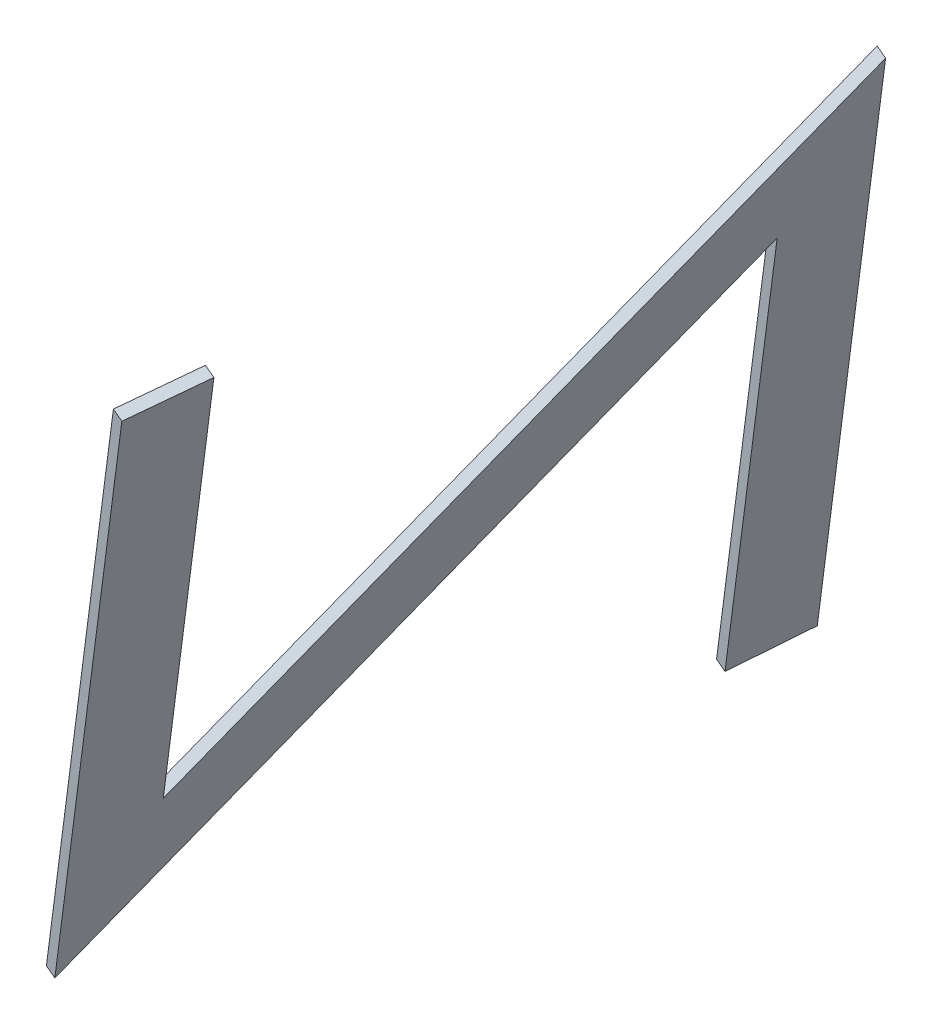
ISO-10303-21;
HEADER;
FILE_DESCRIPTION(('STEP AP214'),'2;1');
FILE_NAME('part.step','',(''),(''),'','','');
FILE_SCHEMA(('AUTOMOTIVE_DESIGN { 1 0 10303 214 1 1 1 1 }'));
ENDSEC;
DATA;
#1=APPLICATION_CONTEXT('core data for automotive mechanical design processes');
#2=APPLICATION_PROTOCOL_DEFINITION('international standard','automotive_design',2000,#1);
#3=PRODUCT_CONTEXT('',#1,'mechanical');
#4=PRODUCT('Part','Part','',(#3));
#5=PRODUCT_RELATED_PRODUCT_CATEGORY('part','',(#4));
#6=PRODUCT_DEFINITION_FORMATION('','',#4);
#7=PRODUCT_DEFINITION_CONTEXT('part definition',#1,'design');
#8=PRODUCT_DEFINITION('design','',#6,#7);
#9=PRODUCT_DEFINITION_SHAPE('','',#8);
#10=(LENGTH_UNIT() NAMED_UNIT(*) SI_UNIT(.MILLI.,.METRE.));
#11=(NAMED_UNIT(*) PLANE_ANGLE_UNIT() SI_UNIT($,.RADIAN.));
#12=(NAMED_UNIT(*) SI_UNIT($,.STERADIAN.) SOLID_ANGLE_UNIT());
#13=UNCERTAINTY_MEASURE_WITH_UNIT(LENGTH_MEASURE(1.E-05),#10,'distance_accuracy_value','');
#14=(GEOMETRIC_REPRESENTATION_CONTEXT(3) GLOBAL_UNCERTAINTY_ASSIGNED_CONTEXT((#13)) GLOBAL_UNIT_ASSIGNED_CONTEXT((#10,
#11,#12)) REPRESENTATION_CONTEXT('',''));
#15=CARTESIAN_POINT('',(0.,0.,0.));
#16=DIRECTION('',(0.,0.,1.));
#17=DIRECTION('',(1.,0.,0.));
#18=AXIS2_PLACEMENT_3D('',#15,#16,#17);
#19=CARTESIAN_POINT('',(-143.821533255554,62.2429283655647,-138.813563890211));
#20=DIRECTION('',(0.251094526540656,0.16569123548096,-0.953676021102616));
#21=DIRECTION('',(0.332083365652077,0.91069878724547,0.245659026227043));
#22=AXIS2_PLACEMENT_3D('',#19,#20,#21);
#23=PLANE('',#22);
#24=DIRECTION('',(-0.909215143405846,0.378383579710355,-0.173648177666983));
#25=VECTOR('',#24,1.);
#26=CARTESIAN_POINT('',(-143.835171482705,62.2486041192603,-138.816168612876));
#27=LINE('',#26,#25);
#28=CARTESIAN_POINT('',(-143.821533255554,62.2429283655647,-138.813563890211));
#29=VERTEX_POINT('',#28);
#30=CARTESIAN_POINT('',(-143.848809709856,62.254279872956,-138.818773335541));
#31=VERTEX_POINT('',#30);
#32=EDGE_CURVE('E35',#29,#31,#27,.T.);
#33=ORIENTED_EDGE('',*,*,#32,.F.);
#34=DIRECTION('',(-0.332083365652076,-0.91069878724547,-0.245659026227044));
#35=VECTOR('',#34,1.);
#36=CARTESIAN_POINT('',(-144.164162366353,61.3033091375413,-139.06702414269));
#37=LINE('',#36,#35);
#38=CARTESIAN_POINT('',(-144.506791477174,60.3636899094328,-139.320484395238));
#39=VERTEX_POINT('',#38);
#40=EDGE_CURVE('E11',#29,#39,#37,.T.);
#41=ORIENTED_EDGE('',*,*,#40,.T.);
#42=DIRECTION('',(-0.909215143405846,0.378383579710355,-0.173648177666983));
#43=VECTOR('',#42,1.);
#44=CARTESIAN_POINT('',(-144.520429704325,60.3693656631284,-139.323089117903));
#45=LINE('',#44,#43);
#46=CARTESIAN_POINT('',(-144.534067931476,60.3750414168241,-139.325693840568));
#47=VERTEX_POINT('',#46);
#48=EDGE_CURVE('E27',#39,#47,#45,.T.);
#49=ORIENTED_EDGE('',*,*,#48,.T.);
#50=DIRECTION('',(-0.332083365652076,-0.91069878724547,-0.245659026227044));
#51=VECTOR('',#50,1.);
#52=CARTESIAN_POINT('',(-144.191438820655,61.3146606449326,-139.07223358802));
#53=LINE('',#52,#51);
#54=EDGE_CURVE('E99',#31,#47,#53,.T.);
#55=ORIENTED_EDGE('',*,*,#54,.F.);
#56=EDGE_LOOP('',(#33,#41,#49,#55));
#57=FACE_BOUND('',#56,.T.);
#58=ADVANCED_FACE('F17',(#57),#23,.T.);
#59=CARTESIAN_POINT('',(-144.506791477174,60.3636899094328,-139.320484395238));
#60=DIRECTION('',(-0.332083365652076,-0.91069878724547,-0.245659026227044));
#61=DIRECTION('',(0.251094526540657,0.165691235480961,-0.953676021102616));
#62=AXIS2_PLACEMENT_3D('',#59,#60,#61);
#63=PLANE('',#62);
#64=ORIENTED_EDGE('',*,*,#48,.F.);
#65=DIRECTION('',(-0.251094526540656,-0.16569123548096,0.953676021102616));
#66=VECTOR('',#65,1.);
#67=CARTESIAN_POINT('',(-144.531900929843,60.3471207858662,-139.225116793091));
#68=LINE('',#67,#66);
#69=CARTESIAN_POINT('',(-144.557010382471,60.330551662336,-139.129749191075));
#70=VERTEX_POINT('',#69);
#71=EDGE_CURVE('E105',#39,#70,#68,.T.);
#72=ORIENTED_EDGE('',*,*,#71,.T.);
#73=DIRECTION('',(-0.909215143405846,0.378383579710355,-0.173648177666983));
#74=VECTOR('',#73,1.);
#75=CARTESIAN_POINT('',(-144.570648609623,60.3362274160316,-139.13235391374));
#76=LINE('',#75,#74);
#77=CARTESIAN_POINT('',(-144.584286836774,60.3419031697273,-139.134958636405));
#78=VERTEX_POINT('',#77);
#79=EDGE_CURVE('E109',#70,#78,#76,.T.);
#80=ORIENTED_EDGE('',*,*,#79,.T.);
#81=DIRECTION('',(-0.251094526540656,-0.16569123548096,0.953676021102616));
#82=VECTOR('',#81,1.);
#83=CARTESIAN_POINT('',(-144.559177384145,60.3584722932575,-139.230326238421));
#84=LINE('',#83,#82);
#85=EDGE_CURVE('E101',#47,#78,#84,.T.);
#86=ORIENTED_EDGE('',*,*,#85,.F.);
#87=EDGE_LOOP('',(#64,#72,#80,#86));
#88=FACE_BOUND('',#87,.T.);
#89=ADVANCED_FACE('F153',(#88),#63,.T.);
#90=CARTESIAN_POINT('',(-144.033520868225,61.7661588473962,-138.742497260892));
#91=DIRECTION('',(0.251094526540656,0.16569123548096,-0.953676021102616));
#92=DIRECTION('',(0.332083365652077,0.91069878724547,0.245659026227043));
#93=AXIS2_PLACEMENT_3D('',#90,#91,#92);
#94=PLANE('',#93);
#95=ORIENTED_EDGE('',*,*,#79,.F.);
#96=DIRECTION('',(0.332083365652076,0.91069878724547,0.245659026227044));
#97=VECTOR('',#96,1.);
#98=CARTESIAN_POINT('',(-144.295265625354,61.0483552548763,-138.936123225933));
#99=LINE('',#98,#97);
#100=CARTESIAN_POINT('',(-144.033520868225,61.7661588473962,-138.742497260892));
#101=VERTEX_POINT('',#100);
#102=EDGE_CURVE('E112',#70,#101,#99,.T.);
#103=ORIENTED_EDGE('',*,*,#102,.T.);
#104=DIRECTION('',(-0.909215143405846,0.378383579710355,-0.173648177666983));
#105=VECTOR('',#104,1.);
#106=CARTESIAN_POINT('',(-144.047159095376,61.7718346010919,-138.745101983557));
#107=LINE('',#106,#105);
#108=CARTESIAN_POINT('',(-144.060797322527,61.7775103547875,-138.747706706222));
#109=VERTEX_POINT('',#108);
#110=EDGE_CURVE('E117',#101,#109,#107,.T.);
#111=ORIENTED_EDGE('',*,*,#110,.T.);
#112=DIRECTION('',(0.332083365652076,0.91069878724547,0.245659026227044));
#113=VECTOR('',#112,1.);
#114=CARTESIAN_POINT('',(-144.322542079656,61.0597067622676,-138.941332671263));
#115=LINE('',#114,#113);
#116=EDGE_CURVE('E114',#78,#109,#115,.T.);
#117=ORIENTED_EDGE('',*,*,#116,.F.);
#118=EDGE_LOOP('',(#95,#103,#111,#117));
#119=FACE_BOUND('',#118,.T.);
#120=ADVANCED_FACE('F157',(#119),#94,.F.);
#121=CARTESIAN_POINT('',(-144.033520868225,61.7661588473962,-138.742497260892));
#122=DIRECTION('',(-0.0546953697724156,-0.522043767959993,-0.851163157602343));
#123=DIRECTION('',(0.412718111459802,0.764392681113385,-0.495345929157942));
#124=AXIS2_PLACEMENT_3D('',#121,#122,#123);
#125=PLANE('',#124);
#126=ORIENTED_EDGE('',*,*,#110,.F.);
#127=DIRECTION('',(-0.412718111459802,-0.764392681113385,0.495345929157942));
#128=VECTOR('',#127,1.);
#129=CARTESIAN_POINT('',(-144.462076102574,60.9724343281783,-138.228143553471));
#130=LINE('',#129,#128);
#131=CARTESIAN_POINT('',(-144.89063133691,60.1787098089847,-137.713789846062));
#132=VERTEX_POINT('',#131);
#133=EDGE_CURVE('E120',#101,#132,#130,.T.);
#134=ORIENTED_EDGE('',*,*,#133,.T.);
#135=DIRECTION('',(-0.909215143405846,0.378383579710355,-0.173648177666983));
#136=VECTOR('',#135,1.);
#137=CARTESIAN_POINT('',(-144.904269564061,60.1843855626803,-137.716394568727));
#138=LINE('',#137,#136);
#139=CARTESIAN_POINT('',(-144.917907791212,60.190061316376,-137.718999291392));
#140=VERTEX_POINT('',#139);
#141=EDGE_CURVE('E125',#132,#140,#138,.T.);
#142=ORIENTED_EDGE('',*,*,#141,.T.);
#143=DIRECTION('',(-0.412718111459802,-0.764392681113385,0.495345929157942));
#144=VECTOR('',#143,1.);
#145=CARTESIAN_POINT('',(-144.489352556876,60.9837858355696,-138.233352998801));
#146=LINE('',#145,#144);
#147=EDGE_CURVE('E122',#109,#140,#146,.T.);
#148=ORIENTED_EDGE('',*,*,#147,.F.);
#149=EDGE_LOOP('',(#126,#134,#142,#148));
#150=FACE_BOUND('',#149,.T.);
#151=ADVANCED_FACE('F160',(#150),#125,.T.);
#152=CARTESIAN_POINT('',(-144.890631336653,60.1787098096945,-137.713789845862));
#153=DIRECTION('',(-0.251094526540656,-0.16569123548096,0.953676021102616));
#154=DIRECTION('',(-0.332083365652077,-0.91069878724547,-0.245659026227043));
#155=AXIS2_PLACEMENT_3D('',#152,#153,#154);
#156=PLANE('',#155);
#157=ORIENTED_EDGE('',*,*,#141,.F.);
#158=DIRECTION('',(0.332083365652076,0.91069878724547,0.245659026227044));
#159=VECTOR('',#158,1.);
#160=CARTESIAN_POINT('',(-144.554519002595,61.1004575593742,-137.465150385991));
#161=LINE('',#160,#159);
#162=CARTESIAN_POINT('',(-144.218406668535,62.0222053090986,-137.216510926031));
#163=VERTEX_POINT('',#162);
#164=EDGE_CURVE('E128',#132,#163,#161,.T.);
#165=ORIENTED_EDGE('',*,*,#164,.T.);
#166=DIRECTION('',(-0.909215143405846,0.378383579710355,-0.173648177666983));
#167=VECTOR('',#166,1.);
#168=CARTESIAN_POINT('',(-144.232044895686,62.0278810627942,-137.219115648696));
#169=LINE('',#168,#167);
#170=CARTESIAN_POINT('',(-144.245683122837,62.0335568164899,-137.221720371361));
#171=VERTEX_POINT('',#170);
#172=EDGE_CURVE('E133',#163,#171,#169,.T.);
#173=ORIENTED_EDGE('',*,*,#172,.T.);
#174=DIRECTION('',(0.332083365652076,0.91069878724547,0.245659026227044));
#175=VECTOR('',#174,1.);
#176=CARTESIAN_POINT('',(-144.581795456897,61.1118090667655,-137.470359831321));
#177=LINE('',#176,#175);
#178=EDGE_CURVE('E130',#140,#171,#177,.T.);
#179=ORIENTED_EDGE('',*,*,#178,.F.);
#180=EDGE_LOOP('',(#157,#165,#173,#179));
#181=FACE_BOUND('',#180,.T.);
#182=ADVANCED_FACE('F163',(#181),#156,.T.);
#183=CARTESIAN_POINT('',(-144.170570299667,62.0488097356362,-137.409008614634));
#184=DIRECTION('',(-0.340871517667753,-0.916053339166555,-0.211312300268316));
#185=DIRECTION('',(0.239028097604382,0.132936625530292,-0.96186975321415));
#186=AXIS2_PLACEMENT_3D('',#183,#184,#185);
#187=PLANE('',#186);
#188=ORIENTED_EDGE('',*,*,#172,.F.);
#189=DIRECTION('',(0.239028097604382,0.132936625530292,-0.96186975321415));
#190=VECTOR('',#189,1.);
#191=CARTESIAN_POINT('',(-144.194488484122,62.0355075223269,-137.312759770312));
#192=LINE('',#191,#190);
#193=CARTESIAN_POINT('',(-144.170570299667,62.0488097356362,-137.409008614634));
#194=VERTEX_POINT('',#193);
#195=EDGE_CURVE('E136',#163,#194,#192,.T.);
#196=ORIENTED_EDGE('',*,*,#195,.T.);
#197=DIRECTION('',(-0.909215143405846,0.378383579710355,-0.173648177666983));
#198=VECTOR('',#197,1.);
#199=CARTESIAN_POINT('',(-144.184208526818,62.0544854893319,-137.411613337299));
#200=LINE('',#199,#198);
#201=CARTESIAN_POINT('',(-144.197846753969,62.0601612430275,-137.414218059964));
#202=VERTEX_POINT('',#201);
#203=EDGE_CURVE('E140',#194,#202,#200,.T.);
#204=ORIENTED_EDGE('',*,*,#203,.T.);
#205=DIRECTION('',(0.239028097604382,0.132936625530292,-0.96186975321415));
#206=VECTOR('',#205,1.);
#207=CARTESIAN_POINT('',(-144.221764938424,62.0468590297182,-137.317969215642));
#208=LINE('',#207,#206);
#209=EDGE_CURVE('E88',#171,#202,#208,.T.);
#210=ORIENTED_EDGE('',*,*,#209,.F.);
#211=EDGE_LOOP('',(#188,#196,#204,#210));
#212=FACE_BOUND('',#211,.T.);
#213=ADVANCED_FACE('F144',(#212),#187,.F.);
#214=CARTESIAN_POINT('',(-144.678643723955,60.6554793277043,-137.78485647566));
#215=DIRECTION('',(-0.251094526540656,-0.16569123548096,0.953676021102616));
#216=DIRECTION('',(-0.332083365652077,-0.91069878724547,-0.245659026227043));
#217=AXIS2_PLACEMENT_3D('',#214,#215,#216);
#218=PLANE('',#217);
#219=ORIENTED_EDGE('',*,*,#203,.F.);
#220=DIRECTION('',(-0.332083365652076,-0.91069878724547,-0.245659026227044));
#221=VECTOR('',#220,1.);
#222=CARTESIAN_POINT('',(-144.424607011812,61.3521445316479,-137.596932545192));
#223=LINE('',#222,#221);
#224=CARTESIAN_POINT('',(-144.678643723955,60.6554793277043,-137.78485647566));
#225=VERTEX_POINT('',#224);
#226=EDGE_CURVE('E94',#194,#225,#223,.T.);
#227=ORIENTED_EDGE('',*,*,#226,.T.);
#228=DIRECTION('',(-0.909215143405846,0.378383579710355,-0.173648177666983));
#229=VECTOR('',#228,1.);
#230=CARTESIAN_POINT('',(-144.692281951106,60.6611550814,-137.787461198325));
#231=LINE('',#230,#229);
#232=CARTESIAN_POINT('',(-144.705920178258,60.6668308350956,-137.790065920991));
#233=VERTEX_POINT('',#232);
#234=EDGE_CURVE('E80',#225,#233,#231,.T.);
#235=ORIENTED_EDGE('',*,*,#234,.T.);
#236=DIRECTION('',(-0.332083365652076,-0.91069878724547,-0.245659026227044));
#237=VECTOR('',#236,1.);
#238=CARTESIAN_POINT('',(-144.451883466114,61.3634960390392,-137.602141990522));
#239=LINE('',#238,#237);
#240=EDGE_CURVE('E86',#202,#233,#239,.T.);
#241=ORIENTED_EDGE('',*,*,#240,.F.);
#242=EDGE_LOOP('',(#219,#227,#235,#241));
#243=FACE_BOUND('',#242,.T.);
#244=ADVANCED_FACE('F92',(#243),#218,.F.);
#245=CARTESIAN_POINT('',(-143.821533255554,62.2429283655647,-138.813563890211));
#246=DIRECTION('',(-0.0546953697724156,-0.522043767959993,-0.851163157602343));
#247=DIRECTION('',(0.412718111459802,0.764392681113385,-0.495345929157942));
#248=AXIS2_PLACEMENT_3D('',#245,#246,#247);
#249=PLANE('',#248);
#250=ORIENTED_EDGE('',*,*,#234,.F.);
#251=DIRECTION('',(0.412718111459802,0.764392681113385,-0.495345929157942));
#252=VECTOR('',#251,1.);
#253=CARTESIAN_POINT('',(-144.250088489744,61.4492038466548,-138.299210182946));
#254=LINE('',#253,#252);
#255=EDGE_CURVE('E96',#225,#29,#254,.T.);
#256=ORIENTED_EDGE('',*,*,#255,.T.);
#257=ORIENTED_EDGE('',*,*,#32,.T.);
#258=DIRECTION('',(0.412718111459802,0.764392681113385,-0.495345929157942));
#259=VECTOR('',#258,1.);
#260=CARTESIAN_POINT('',(-144.277364944046,61.4605553540461,-138.304419628276));
#261=LINE('',#260,#259);
#262=EDGE_CURVE('E21',#233,#31,#261,.T.);
#263=ORIENTED_EDGE('',*,*,#262,.F.);
#264=EDGE_LOOP('',(#250,#256,#257,#263));
#265=FACE_BOUND('',#264,.T.);
#266=ADVANCED_FACE('F98',(#265),#249,.F.);
#267=CARTESIAN_POINT('',(-140.197105636582,63.1845344254721,-155.739144366844));
#268=DIRECTION('',(-0.909215143405846,0.378383579710355,-0.173648177666983));
#269=DIRECTION('',(-0.015180111181639,-0.4469491584612,-0.894430552908015));
#270=AXIS2_PLACEMENT_3D('',#267,#268,#269);
#271=PLANE('',#270);
#272=ORIENTED_EDGE('',*,*,#255,.F.);
#273=ORIENTED_EDGE('',*,*,#226,.F.);
#274=ORIENTED_EDGE('',*,*,#195,.F.);
#275=ORIENTED_EDGE('',*,*,#164,.F.);
#276=ORIENTED_EDGE('',*,*,#133,.F.);
#277=ORIENTED_EDGE('',*,*,#102,.F.);
#278=ORIENTED_EDGE('',*,*,#71,.F.);
#279=ORIENTED_EDGE('',*,*,#40,.F.);
#280=EDGE_LOOP('',(#272,#273,#274,#275,#276,#277,#278,#279));
#281=FACE_BOUND('',#280,.T.);
#282=ADVANCED_FACE('F148',(#281),#271,.F.);
#283=CARTESIAN_POINT('',(-140.224382090884,63.1958859328634,-155.744353812174));
#284=DIRECTION('',(-0.909215143405846,0.378383579710355,-0.173648177666983));
#285=DIRECTION('',(-0.015180111181639,-0.4469491584612,-0.894430552908015));
#286=AXIS2_PLACEMENT_3D('',#283,#284,#285);
#287=PLANE('',#286);
#288=ORIENTED_EDGE('',*,*,#54,.T.);
#289=ORIENTED_EDGE('',*,*,#85,.T.);
#290=ORIENTED_EDGE('',*,*,#116,.T.);
#291=ORIENTED_EDGE('',*,*,#147,.T.);
#292=ORIENTED_EDGE('',*,*,#178,.T.);
#293=ORIENTED_EDGE('',*,*,#209,.T.);
#294=ORIENTED_EDGE('',*,*,#240,.T.);
#295=ORIENTED_EDGE('',*,*,#262,.T.);
#296=EDGE_LOOP('',(#288,#289,#290,#291,#292,#293,#294,#295));
#297=FACE_BOUND('',#296,.T.);
#298=ADVANCED_FACE('F19',(#297),#287,.T.);
#299=CLOSED_SHELL('',(#58,#89,#120,#151,#182,#213,#244,#266,#282,#298));
#300=MANIFOLD_SOLID_BREP('B1',#299);
#301=ADVANCED_BREP_SHAPE_REPRESENTATION('',(#18,#300),#14);
#302=SHAPE_DEFINITION_REPRESENTATION(#9,#301);
ENDSEC;
END-ISO-10303-21;
